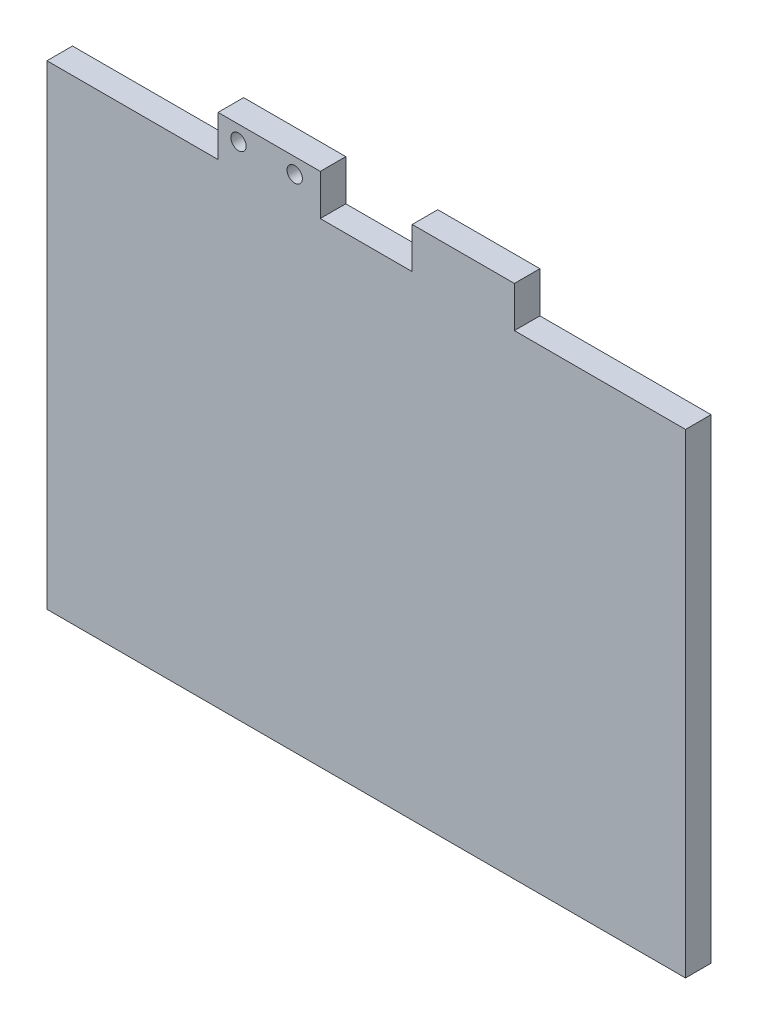
ISO-10303-21;
HEADER;
FILE_DESCRIPTION(('STEP AP214'),'2;1');
FILE_NAME('part.step','',(''),(''),'','','');
FILE_SCHEMA(('AUTOMOTIVE_DESIGN { 1 0 10303 214 1 1 1 1 }'));
ENDSEC;
DATA;
#1=APPLICATION_CONTEXT('core data for automotive mechanical design processes');
#2=APPLICATION_PROTOCOL_DEFINITION('international standard','automotive_design',2000,#1);
#3=PRODUCT_CONTEXT('',#1,'mechanical');
#4=PRODUCT('Part','Part','',(#3));
#5=PRODUCT_RELATED_PRODUCT_CATEGORY('part','',(#4));
#6=PRODUCT_DEFINITION_FORMATION('','',#4);
#7=PRODUCT_DEFINITION_CONTEXT('part definition',#1,'design');
#8=PRODUCT_DEFINITION('design','',#6,#7);
#9=PRODUCT_DEFINITION_SHAPE('','',#8);
#10=(LENGTH_UNIT() NAMED_UNIT(*) SI_UNIT(.MILLI.,.METRE.));
#11=(NAMED_UNIT(*) PLANE_ANGLE_UNIT() SI_UNIT($,.RADIAN.));
#12=(NAMED_UNIT(*) SI_UNIT($,.STERADIAN.) SOLID_ANGLE_UNIT());
#13=UNCERTAINTY_MEASURE_WITH_UNIT(LENGTH_MEASURE(1.E-05),#10,'distance_accuracy_value','');
#14=(GEOMETRIC_REPRESENTATION_CONTEXT(3) GLOBAL_UNCERTAINTY_ASSIGNED_CONTEXT((#13)) GLOBAL_UNIT_ASSIGNED_CONTEXT((#10,
#11,#12)) REPRESENTATION_CONTEXT('',''));
#15=CARTESIAN_POINT('',(0.,0.,0.));
#16=DIRECTION('',(0.,0.,1.));
#17=DIRECTION('',(1.,0.,0.));
#18=AXIS2_PLACEMENT_3D('',#15,#16,#17);
#19=CARTESIAN_POINT('',(-1.55698672911795,38.1428571428572,5.));
#20=DIRECTION('',(-1.,0.,0.));
#21=DIRECTION('',(0.,0.,1.));
#22=AXIS2_PLACEMENT_3D('',#19,#20,#21);
#23=PLANE('',#22);
#24=DIRECTION('',(0.,1.,0.));
#25=VECTOR('',#24,1.);
#26=CARTESIAN_POINT('',(-1.55698672911795,38.1428571428572,0.));
#27=LINE('',#26,#25);
#28=CARTESIAN_POINT('',(-1.55698672911795,38.1428571428572,0.));
#29=VERTEX_POINT('',#28);
#30=CARTESIAN_POINT('',(-1.55698672911795,46.1428571428572,0.));
#31=VERTEX_POINT('',#30);
#32=EDGE_CURVE('E156',#29,#31,#27,.T.);
#33=ORIENTED_EDGE('',*,*,#32,.T.);
#34=DIRECTION('',(0.,0.,-1.));
#35=VECTOR('',#34,1.);
#36=CARTESIAN_POINT('',(-1.55698672911795,46.1428571428572,5.));
#37=LINE('',#36,#35);
#38=CARTESIAN_POINT('',(-1.55698672911795,46.1428571428572,5.));
#39=VERTEX_POINT('',#38);
#40=EDGE_CURVE('E11',#39,#31,#37,.T.);
#41=ORIENTED_EDGE('',*,*,#40,.F.);
#42=DIRECTION('',(0.,1.,0.));
#43=VECTOR('',#42,1.);
#44=CARTESIAN_POINT('',(-1.55698672911795,38.1428571428572,5.));
#45=LINE('',#44,#43);
#46=CARTESIAN_POINT('',(-1.55698672911795,38.1428571428572,5.));
#47=VERTEX_POINT('',#46);
#48=EDGE_CURVE('E102',#47,#39,#45,.T.);
#49=ORIENTED_EDGE('',*,*,#48,.F.);
#50=DIRECTION('',(0.,0.,-1.));
#51=VECTOR('',#50,1.);
#52=CARTESIAN_POINT('',(-1.55698672911795,38.1428571428572,5.));
#53=LINE('',#52,#51);
#54=EDGE_CURVE('E53',#47,#29,#53,.T.);
#55=ORIENTED_EDGE('',*,*,#54,.T.);
#56=EDGE_LOOP('',(#33,#41,#49,#55));
#57=FACE_BOUND('',#56,.T.);
#58=ADVANCED_FACE('F35',(#57),#23,.F.);
#59=CARTESIAN_POINT('',(-21.5569867291179,46.1428571428572,5.));
#60=DIRECTION('',(0.,1.,0.));
#61=DIRECTION('',(0.,0.,1.));
#62=AXIS2_PLACEMENT_3D('',#59,#60,#61);
#63=PLANE('',#62);
#64=DIRECTION('',(1.,0.,0.));
#65=VECTOR('',#64,1.);
#66=CARTESIAN_POINT('',(-21.5569867291179,46.1428571428572,0.));
#67=LINE('',#66,#65);
#68=CARTESIAN_POINT('',(-21.5569867291179,46.1428571428572,0.));
#69=VERTEX_POINT('',#68);
#70=EDGE_CURVE('E158',#69,#31,#67,.T.);
#71=ORIENTED_EDGE('',*,*,#70,.F.);
#72=DIRECTION('',(0.,0.,-1.));
#73=VECTOR('',#72,1.);
#74=CARTESIAN_POINT('',(-21.5569867291179,46.1428571428572,5.));
#75=LINE('',#74,#73);
#76=CARTESIAN_POINT('',(-21.5569867291179,46.1428571428572,5.));
#77=VERTEX_POINT('',#76);
#78=EDGE_CURVE('E44',#77,#69,#75,.T.);
#79=ORIENTED_EDGE('',*,*,#78,.F.);
#80=DIRECTION('',(1.,0.,0.));
#81=VECTOR('',#80,1.);
#82=CARTESIAN_POINT('',(-21.5569867291179,46.1428571428572,5.));
#83=LINE('',#82,#81);
#84=EDGE_CURVE('E217',#77,#39,#83,.T.);
#85=ORIENTED_EDGE('',*,*,#84,.T.);
#86=ORIENTED_EDGE('',*,*,#40,.T.);
#87=EDGE_LOOP('',(#71,#79,#85,#86));
#88=FACE_BOUND('',#87,.T.);
#89=ADVANCED_FACE('F261',(#88),#63,.T.);
#90=CARTESIAN_POINT('',(-21.5569867291179,38.1428571428572,5.));
#91=DIRECTION('',(-1.,0.,0.));
#92=DIRECTION('',(0.,-1.,0.));
#93=AXIS2_PLACEMENT_3D('',#90,#91,#92);
#94=PLANE('',#93);
#95=DIRECTION('',(0.,1.,0.));
#96=VECTOR('',#95,1.);
#97=CARTESIAN_POINT('',(-21.5569867291179,38.1428571428572,0.));
#98=LINE('',#97,#96);
#99=CARTESIAN_POINT('',(-21.5569867291179,38.1428571428572,0.));
#100=VERTEX_POINT('',#99);
#101=EDGE_CURVE('E162',#100,#69,#98,.T.);
#102=ORIENTED_EDGE('',*,*,#101,.F.);
#103=DIRECTION('',(0.,0.,-1.));
#104=VECTOR('',#103,1.);
#105=CARTESIAN_POINT('',(-21.5569867291179,38.1428571428572,5.));
#106=LINE('',#105,#104);
#107=CARTESIAN_POINT('',(-21.5569867291179,38.1428571428572,5.));
#108=VERTEX_POINT('',#107);
#109=EDGE_CURVE('E202',#108,#100,#106,.T.);
#110=ORIENTED_EDGE('',*,*,#109,.F.);
#111=DIRECTION('',(0.,1.,0.));
#112=VECTOR('',#111,1.);
#113=CARTESIAN_POINT('',(-21.5569867291179,38.1428571428572,5.));
#114=LINE('',#113,#112);
#115=EDGE_CURVE('E220',#108,#77,#114,.T.);
#116=ORIENTED_EDGE('',*,*,#115,.T.);
#117=ORIENTED_EDGE('',*,*,#78,.T.);
#118=EDGE_LOOP('',(#102,#110,#116,#117));
#119=FACE_BOUND('',#118,.T.);
#120=ADVANCED_FACE('F265',(#119),#94,.T.);
#121=CARTESIAN_POINT('',(-55.056986729118,38.1428571428572,5.));
#122=DIRECTION('',(0.,1.,0.));
#123=DIRECTION('',(0.,0.,1.));
#124=AXIS2_PLACEMENT_3D('',#121,#122,#123);
#125=PLANE('',#124);
#126=DIRECTION('',(1.,0.,0.));
#127=VECTOR('',#126,1.);
#128=CARTESIAN_POINT('',(-55.056986729118,38.1428571428572,0.));
#129=LINE('',#128,#127);
#130=CARTESIAN_POINT('',(-55.056986729118,38.1428571428572,0.));
#131=VERTEX_POINT('',#130);
#132=EDGE_CURVE('E165',#131,#100,#129,.T.);
#133=ORIENTED_EDGE('',*,*,#132,.F.);
#134=DIRECTION('',(0.,0.,-1.));
#135=VECTOR('',#134,1.);
#136=CARTESIAN_POINT('',(-55.056986729118,38.1428571428572,5.));
#137=LINE('',#136,#135);
#138=CARTESIAN_POINT('',(-55.056986729118,38.1428571428572,5.));
#139=VERTEX_POINT('',#138);
#140=EDGE_CURVE('E200',#139,#131,#137,.T.);
#141=ORIENTED_EDGE('',*,*,#140,.F.);
#142=DIRECTION('',(1.,0.,0.));
#143=VECTOR('',#142,1.);
#144=CARTESIAN_POINT('',(-55.056986729118,38.1428571428572,5.));
#145=LINE('',#144,#143);
#146=EDGE_CURVE('E223',#139,#108,#145,.T.);
#147=ORIENTED_EDGE('',*,*,#146,.T.);
#148=ORIENTED_EDGE('',*,*,#109,.T.);
#149=EDGE_LOOP('',(#133,#141,#147,#148));
#150=FACE_BOUND('',#149,.T.);
#151=ADVANCED_FACE('F274',(#150),#125,.T.);
#152=CARTESIAN_POINT('',(-55.056986729118,-54.8571428571428,5.));
#153=DIRECTION('',(-1.,0.,0.));
#154=DIRECTION('',(0.,0.,1.));
#155=AXIS2_PLACEMENT_3D('',#152,#153,#154);
#156=PLANE('',#155);
#157=DIRECTION('',(0.,1.,0.));
#158=VECTOR('',#157,1.);
#159=CARTESIAN_POINT('',(-55.056986729118,-54.8571428571428,0.));
#160=LINE('',#159,#158);
#161=CARTESIAN_POINT('',(-55.056986729118,-54.8571428571428,0.));
#162=VERTEX_POINT('',#161);
#163=EDGE_CURVE('E168',#162,#131,#160,.T.);
#164=ORIENTED_EDGE('',*,*,#163,.F.);
#165=DIRECTION('',(0.,0.,-1.));
#166=VECTOR('',#165,1.);
#167=CARTESIAN_POINT('',(-55.056986729118,-54.8571428571428,5.));
#168=LINE('',#167,#166);
#169=CARTESIAN_POINT('',(-55.056986729118,-54.8571428571428,5.));
#170=VERTEX_POINT('',#169);
#171=EDGE_CURVE('E198',#170,#162,#168,.T.);
#172=ORIENTED_EDGE('',*,*,#171,.F.);
#173=DIRECTION('',(0.,1.,0.));
#174=VECTOR('',#173,1.);
#175=CARTESIAN_POINT('',(-55.056986729118,-54.8571428571428,5.));
#176=LINE('',#175,#174);
#177=EDGE_CURVE('E226',#170,#139,#176,.T.);
#178=ORIENTED_EDGE('',*,*,#177,.T.);
#179=ORIENTED_EDGE('',*,*,#140,.T.);
#180=EDGE_LOOP('',(#164,#172,#178,#179));
#181=FACE_BOUND('',#180,.T.);
#182=ADVANCED_FACE('F277',(#181),#156,.T.);
#183=CARTESIAN_POINT('',(-55.056986729118,-54.8571428571428,5.));
#184=DIRECTION('',(0.,1.,0.));
#185=DIRECTION('',(0.,0.,1.));
#186=AXIS2_PLACEMENT_3D('',#183,#184,#185);
#187=PLANE('',#186);
#188=DIRECTION('',(1.,0.,0.));
#189=VECTOR('',#188,1.);
#190=CARTESIAN_POINT('',(-55.056986729118,-54.8571428571428,0.));
#191=LINE('',#190,#189);
#192=CARTESIAN_POINT('',(69.943013270882,-54.8571428571428,0.));
#193=VERTEX_POINT('',#192);
#194=EDGE_CURVE('E171',#162,#193,#191,.T.);
#195=ORIENTED_EDGE('',*,*,#194,.T.);
#196=DIRECTION('',(0.,0.,-1.));
#197=VECTOR('',#196,1.);
#198=CARTESIAN_POINT('',(69.943013270882,-54.8571428571428,5.));
#199=LINE('',#198,#197);
#200=CARTESIAN_POINT('',(69.943013270882,-54.8571428571428,5.));
#201=VERTEX_POINT('',#200);
#202=EDGE_CURVE('E195',#201,#193,#199,.T.);
#203=ORIENTED_EDGE('',*,*,#202,.F.);
#204=DIRECTION('',(1.,0.,0.));
#205=VECTOR('',#204,1.);
#206=CARTESIAN_POINT('',(-55.056986729118,-54.8571428571428,5.));
#207=LINE('',#206,#205);
#208=EDGE_CURVE('E229',#170,#201,#207,.T.);
#209=ORIENTED_EDGE('',*,*,#208,.F.);
#210=ORIENTED_EDGE('',*,*,#171,.T.);
#211=EDGE_LOOP('',(#195,#203,#209,#210));
#212=FACE_BOUND('',#211,.T.);
#213=ADVANCED_FACE('F279',(#212),#187,.F.);
#214=CARTESIAN_POINT('',(69.943013270882,-54.8571428571428,5.));
#215=DIRECTION('',(-1.,0.,0.));
#216=DIRECTION('',(0.,0.,1.));
#217=AXIS2_PLACEMENT_3D('',#214,#215,#216);
#218=PLANE('',#217);
#219=DIRECTION('',(0.,1.,0.));
#220=VECTOR('',#219,1.);
#221=CARTESIAN_POINT('',(69.943013270882,-54.8571428571428,0.));
#222=LINE('',#221,#220);
#223=CARTESIAN_POINT('',(69.943013270882,38.1428571428572,0.));
#224=VERTEX_POINT('',#223);
#225=EDGE_CURVE('E173',#193,#224,#222,.T.);
#226=ORIENTED_EDGE('',*,*,#225,.T.);
#227=DIRECTION('',(0.,0.,-1.));
#228=VECTOR('',#227,1.);
#229=CARTESIAN_POINT('',(69.943013270882,38.1428571428572,5.));
#230=LINE('',#229,#228);
#231=CARTESIAN_POINT('',(69.943013270882,38.1428571428572,5.));
#232=VERTEX_POINT('',#231);
#233=EDGE_CURVE('E193',#232,#224,#230,.T.);
#234=ORIENTED_EDGE('',*,*,#233,.F.);
#235=DIRECTION('',(0.,1.,0.));
#236=VECTOR('',#235,1.);
#237=CARTESIAN_POINT('',(69.943013270882,-54.8571428571428,5.));
#238=LINE('',#237,#236);
#239=EDGE_CURVE('E231',#201,#232,#238,.T.);
#240=ORIENTED_EDGE('',*,*,#239,.F.);
#241=ORIENTED_EDGE('',*,*,#202,.T.);
#242=EDGE_LOOP('',(#226,#234,#240,#241));
#243=FACE_BOUND('',#242,.T.);
#244=ADVANCED_FACE('F244',(#243),#218,.F.);
#245=CARTESIAN_POINT('',(36.4430132708821,38.1428571428572,5.));
#246=DIRECTION('',(0.,1.,0.));
#247=DIRECTION('',(0.,0.,1.));
#248=AXIS2_PLACEMENT_3D('',#245,#246,#247);
#249=PLANE('',#248);
#250=DIRECTION('',(1.,0.,0.));
#251=VECTOR('',#250,1.);
#252=CARTESIAN_POINT('',(36.4430132708821,38.1428571428572,0.));
#253=LINE('',#252,#251);
#254=CARTESIAN_POINT('',(36.4430132708821,38.1428571428572,0.));
#255=VERTEX_POINT('',#254);
#256=EDGE_CURVE('E176',#255,#224,#253,.T.);
#257=ORIENTED_EDGE('',*,*,#256,.F.);
#258=DIRECTION('',(0.,0.,-1.));
#259=VECTOR('',#258,1.);
#260=CARTESIAN_POINT('',(36.4430132708821,38.1428571428572,5.));
#261=LINE('',#260,#259);
#262=CARTESIAN_POINT('',(36.4430132708821,38.1428571428572,5.));
#263=VERTEX_POINT('',#262);
#264=EDGE_CURVE('E191',#263,#255,#261,.T.);
#265=ORIENTED_EDGE('',*,*,#264,.F.);
#266=DIRECTION('',(1.,0.,0.));
#267=VECTOR('',#266,1.);
#268=CARTESIAN_POINT('',(36.4430132708821,38.1428571428572,5.));
#269=LINE('',#268,#267);
#270=EDGE_CURVE('E233',#263,#232,#269,.T.);
#271=ORIENTED_EDGE('',*,*,#270,.T.);
#272=ORIENTED_EDGE('',*,*,#233,.T.);
#273=EDGE_LOOP('',(#257,#265,#271,#272));
#274=FACE_BOUND('',#273,.T.);
#275=ADVANCED_FACE('F237',(#274),#249,.T.);
#276=CARTESIAN_POINT('',(36.4430132708821,38.1428571428572,5.));
#277=DIRECTION('',(-1.,0.,0.));
#278=DIRECTION('',(0.,0.,1.));
#279=AXIS2_PLACEMENT_3D('',#276,#277,#278);
#280=PLANE('',#279);
#281=DIRECTION('',(0.,1.,0.));
#282=VECTOR('',#281,1.);
#283=CARTESIAN_POINT('',(36.4430132708821,38.1428571428572,0.));
#284=LINE('',#283,#282);
#285=CARTESIAN_POINT('',(36.4430132708821,46.1428571428572,0.));
#286=VERTEX_POINT('',#285);
#287=EDGE_CURVE('E179',#255,#286,#284,.T.);
#288=ORIENTED_EDGE('',*,*,#287,.T.);
#289=DIRECTION('',(0.,0.,-1.));
#290=VECTOR('',#289,1.);
#291=CARTESIAN_POINT('',(36.4430132708821,46.1428571428572,5.));
#292=LINE('',#291,#290);
#293=CARTESIAN_POINT('',(36.4430132708821,46.1428571428572,5.));
#294=VERTEX_POINT('',#293);
#295=EDGE_CURVE('E140',#294,#286,#292,.T.);
#296=ORIENTED_EDGE('',*,*,#295,.F.);
#297=DIRECTION('',(0.,1.,0.));
#298=VECTOR('',#297,1.);
#299=CARTESIAN_POINT('',(36.4430132708821,38.1428571428572,5.));
#300=LINE('',#299,#298);
#301=EDGE_CURVE('E147',#263,#294,#300,.T.);
#302=ORIENTED_EDGE('',*,*,#301,.F.);
#303=ORIENTED_EDGE('',*,*,#264,.T.);
#304=EDGE_LOOP('',(#288,#296,#302,#303));
#305=FACE_BOUND('',#304,.T.);
#306=ADVANCED_FACE('F251',(#305),#280,.F.);
#307=CARTESIAN_POINT('',(16.4430132708821,46.1428571428572,5.));
#308=DIRECTION('',(0.,1.,0.));
#309=DIRECTION('',(0.,0.,1.));
#310=AXIS2_PLACEMENT_3D('',#307,#308,#309);
#311=PLANE('',#310);
#312=DIRECTION('',(1.,0.,0.));
#313=VECTOR('',#312,1.);
#314=CARTESIAN_POINT('',(16.4430132708821,46.1428571428572,0.));
#315=LINE('',#314,#313);
#316=CARTESIAN_POINT('',(16.4430132708821,46.1428571428572,0.));
#317=VERTEX_POINT('',#316);
#318=EDGE_CURVE('E136',#317,#286,#315,.T.);
#319=ORIENTED_EDGE('',*,*,#318,.F.);
#320=DIRECTION('',(0.,0.,-1.));
#321=VECTOR('',#320,1.);
#322=CARTESIAN_POINT('',(16.4430132708821,46.1428571428572,5.));
#323=LINE('',#322,#321);
#324=CARTESIAN_POINT('',(16.4430132708821,46.1428571428572,5.));
#325=VERTEX_POINT('',#324);
#326=EDGE_CURVE('E131',#325,#317,#323,.T.);
#327=ORIENTED_EDGE('',*,*,#326,.F.);
#328=DIRECTION('',(1.,0.,0.));
#329=VECTOR('',#328,1.);
#330=CARTESIAN_POINT('',(16.4430132708821,46.1428571428572,5.));
#331=LINE('',#330,#329);
#332=EDGE_CURVE('E134',#325,#294,#331,.T.);
#333=ORIENTED_EDGE('',*,*,#332,.T.);
#334=ORIENTED_EDGE('',*,*,#295,.T.);
#335=EDGE_LOOP('',(#319,#327,#333,#334));
#336=FACE_BOUND('',#335,.T.);
#337=ADVANCED_FACE('F133',(#336),#311,.T.);
#338=CARTESIAN_POINT('',(16.4430132708821,38.1428571428572,5.));
#339=DIRECTION('',(-1.,0.,0.));
#340=DIRECTION('',(0.,0.,1.));
#341=AXIS2_PLACEMENT_3D('',#338,#339,#340);
#342=PLANE('',#341);
#343=DIRECTION('',(0.,1.,0.));
#344=VECTOR('',#343,1.);
#345=CARTESIAN_POINT('',(16.4430132708821,38.1428571428572,0.));
#346=LINE('',#345,#344);
#347=CARTESIAN_POINT('',(16.4430132708821,38.1428571428572,0.));
#348=VERTEX_POINT('',#347);
#349=EDGE_CURVE('E183',#348,#317,#346,.T.);
#350=ORIENTED_EDGE('',*,*,#349,.F.);
#351=DIRECTION('',(0.,0.,-1.));
#352=VECTOR('',#351,1.);
#353=CARTESIAN_POINT('',(16.4430132708821,38.1428571428572,5.));
#354=LINE('',#353,#352);
#355=CARTESIAN_POINT('',(16.4430132708821,38.1428571428572,5.));
#356=VERTEX_POINT('',#355);
#357=EDGE_CURVE('E90',#356,#348,#354,.T.);
#358=ORIENTED_EDGE('',*,*,#357,.F.);
#359=DIRECTION('',(0.,1.,0.));
#360=VECTOR('',#359,1.);
#361=CARTESIAN_POINT('',(16.4430132708821,38.1428571428572,5.));
#362=LINE('',#361,#360);
#363=EDGE_CURVE('E144',#356,#325,#362,.T.);
#364=ORIENTED_EDGE('',*,*,#363,.T.);
#365=ORIENTED_EDGE('',*,*,#326,.T.);
#366=EDGE_LOOP('',(#350,#358,#364,#365));
#367=FACE_BOUND('',#366,.T.);
#368=ADVANCED_FACE('F150',(#367),#342,.T.);
#369=CARTESIAN_POINT('',(-1.55698672911795,38.1428571428572,5.));
#370=DIRECTION('',(0.,1.,0.));
#371=DIRECTION('',(0.,0.,1.));
#372=AXIS2_PLACEMENT_3D('',#369,#370,#371);
#373=PLANE('',#372);
#374=DIRECTION('',(1.,0.,0.));
#375=VECTOR('',#374,1.);
#376=CARTESIAN_POINT('',(-1.55698672911795,38.1428571428572,0.));
#377=LINE('',#376,#375);
#378=EDGE_CURVE('E185',#29,#348,#377,.T.);
#379=ORIENTED_EDGE('',*,*,#378,.F.);
#380=ORIENTED_EDGE('',*,*,#54,.F.);
#381=DIRECTION('',(1.,0.,0.));
#382=VECTOR('',#381,1.);
#383=CARTESIAN_POINT('',(-1.55698672911795,38.1428571428572,5.));
#384=LINE('',#383,#382);
#385=EDGE_CURVE('E151',#47,#356,#384,.T.);
#386=ORIENTED_EDGE('',*,*,#385,.T.);
#387=ORIENTED_EDGE('',*,*,#357,.T.);
#388=EDGE_LOOP('',(#379,#380,#386,#387));
#389=FACE_BOUND('',#388,.T.);
#390=ADVANCED_FACE('F339',(#389),#373,.T.);
#391=CARTESIAN_POINT('',(0.,0.,5.));
#392=DIRECTION('',(0.,0.,-1.));
#393=DIRECTION('',(-1.,0.,0.));
#394=AXIS2_PLACEMENT_3D('',#391,#392,#393);
#395=PLANE('',#394);
#396=CARTESIAN_POINT('',(-6.55698672911795,43.1428571428572,5.));
#397=DIRECTION('',(0.,0.,1.));
#398=DIRECTION('',(1.,0.,0.));
#399=AXIS2_PLACEMENT_3D('',#396,#397,#398);
#400=CIRCLE('',#399,1.5);
#401=CARTESIAN_POINT('',(-5.05698672911795,43.1428571428572,5.));
#402=VERTEX_POINT('',#401);
#403=EDGE_CURVE('E213',#402,#402,#400,.T.);
#404=ORIENTED_EDGE('',*,*,#403,.F.);
#405=EDGE_LOOP('',(#404));
#406=FACE_BOUND('',#405,.T.);
#407=CARTESIAN_POINT('',(-17.5569867291179,43.1428571428572,5.));
#408=DIRECTION('',(0.,0.,1.));
#409=DIRECTION('',(1.,0.,0.));
#410=AXIS2_PLACEMENT_3D('',#407,#408,#409);
#411=CIRCLE('',#410,1.5);
#412=CARTESIAN_POINT('',(-16.0569867291179,43.1428571428572,5.));
#413=VERTEX_POINT('',#412);
#414=EDGE_CURVE('E205',#413,#413,#411,.T.);
#415=ORIENTED_EDGE('',*,*,#414,.F.);
#416=EDGE_LOOP('',(#415));
#417=FACE_BOUND('',#416,.T.);
#418=ORIENTED_EDGE('',*,*,#48,.T.);
#419=ORIENTED_EDGE('',*,*,#84,.F.);
#420=ORIENTED_EDGE('',*,*,#115,.F.);
#421=ORIENTED_EDGE('',*,*,#146,.F.);
#422=ORIENTED_EDGE('',*,*,#177,.F.);
#423=ORIENTED_EDGE('',*,*,#208,.T.);
#424=ORIENTED_EDGE('',*,*,#239,.T.);
#425=ORIENTED_EDGE('',*,*,#270,.F.);
#426=ORIENTED_EDGE('',*,*,#301,.T.);
#427=ORIENTED_EDGE('',*,*,#332,.F.);
#428=ORIENTED_EDGE('',*,*,#363,.F.);
#429=ORIENTED_EDGE('',*,*,#385,.F.);
#430=EDGE_LOOP('',(#418,#419,#420,#421,#422,#423,#424,#425,#426,#427,#428,#429));
#431=FACE_BOUND('',#430,.T.);
#432=ADVANCED_FACE('F143',(#406,#417,#431),#395,.F.);
#433=CARTESIAN_POINT('',(0.,0.,0.));
#434=DIRECTION('',(0.,0.,-1.));
#435=DIRECTION('',(-1.,0.,0.));
#436=AXIS2_PLACEMENT_3D('',#433,#434,#435);
#437=PLANE('',#436);
#438=CARTESIAN_POINT('',(-6.55698672911795,43.1428571428572,0.));
#439=DIRECTION('',(0.,0.,-1.));
#440=DIRECTION('',(-1.,0.,0.));
#441=AXIS2_PLACEMENT_3D('',#438,#439,#440);
#442=CIRCLE('',#441,1.5);
#443=CARTESIAN_POINT('',(-8.05698672911795,43.1428571428572,0.));
#444=VERTEX_POINT('',#443);
#445=EDGE_CURVE('E38',#444,#444,#442,.T.);
#446=ORIENTED_EDGE('',*,*,#445,.F.);
#447=EDGE_LOOP('',(#446));
#448=FACE_BOUND('',#447,.T.);
#449=CARTESIAN_POINT('',(-17.5569867291179,43.1428571428572,0.));
#450=DIRECTION('',(0.,0.,-1.));
#451=DIRECTION('',(-1.,0.,0.));
#452=AXIS2_PLACEMENT_3D('',#449,#450,#451);
#453=CIRCLE('',#452,1.5);
#454=CARTESIAN_POINT('',(-19.0569867291179,43.1428571428572,0.));
#455=VERTEX_POINT('',#454);
#456=EDGE_CURVE('E159',#455,#455,#453,.T.);
#457=ORIENTED_EDGE('',*,*,#456,.F.);
#458=EDGE_LOOP('',(#457));
#459=FACE_BOUND('',#458,.T.);
#460=ORIENTED_EDGE('',*,*,#32,.F.);
#461=ORIENTED_EDGE('',*,*,#378,.T.);
#462=ORIENTED_EDGE('',*,*,#349,.T.);
#463=ORIENTED_EDGE('',*,*,#318,.T.);
#464=ORIENTED_EDGE('',*,*,#287,.F.);
#465=ORIENTED_EDGE('',*,*,#256,.T.);
#466=ORIENTED_EDGE('',*,*,#225,.F.);
#467=ORIENTED_EDGE('',*,*,#194,.F.);
#468=ORIENTED_EDGE('',*,*,#163,.T.);
#469=ORIENTED_EDGE('',*,*,#132,.T.);
#470=ORIENTED_EDGE('',*,*,#101,.T.);
#471=ORIENTED_EDGE('',*,*,#70,.T.);
#472=EDGE_LOOP('',(#460,#461,#462,#463,#464,#465,#466,#467,#468,#469,#470,#471));
#473=FACE_BOUND('',#472,.T.);
#474=ADVANCED_FACE('F249',(#448,#459,#473),#437,.T.);
#475=CARTESIAN_POINT('',(-17.5569867291179,43.1428571428572,-5.));
#476=DIRECTION('',(0.,0.,1.));
#477=DIRECTION('',(1.,0.,0.));
#478=AXIS2_PLACEMENT_3D('',#475,#476,#477);
#479=CYLINDRICAL_SURFACE('',#478,1.5);
#480=ORIENTED_EDGE('',*,*,#456,.T.);
#481=EDGE_LOOP('',(#480));
#482=FACE_BOUND('',#481,.T.);
#483=ORIENTED_EDGE('',*,*,#414,.T.);
#484=EDGE_LOOP('',(#483));
#485=FACE_BOUND('',#484,.T.);
#486=ADVANCED_FACE('F365',(#482,#485),#479,.F.);
#487=CARTESIAN_POINT('',(-6.55698672911795,43.1428571428572,-5.));
#488=DIRECTION('',(0.,0.,1.));
#489=DIRECTION('',(1.,0.,0.));
#490=AXIS2_PLACEMENT_3D('',#487,#488,#489);
#491=CYLINDRICAL_SURFACE('',#490,1.5);
#492=ORIENTED_EDGE('',*,*,#445,.T.);
#493=EDGE_LOOP('',(#492));
#494=FACE_BOUND('',#493,.T.);
#495=ORIENTED_EDGE('',*,*,#403,.T.);
#496=EDGE_LOOP('',(#495));
#497=FACE_BOUND('',#496,.T.);
#498=ADVANCED_FACE('F375',(#494,#497),#491,.F.);
#499=CLOSED_SHELL('',(#58,#89,#120,#151,#182,#213,#244,#275,#306,#337,#368,#390,#432,#474,#486,#498));
#500=MANIFOLD_SOLID_BREP('B2',#499);
#501=ADVANCED_BREP_SHAPE_REPRESENTATION('',(#18,#500),#14);
#502=SHAPE_DEFINITION_REPRESENTATION(#9,#501);
ENDSEC;
END-ISO-10303-21;
